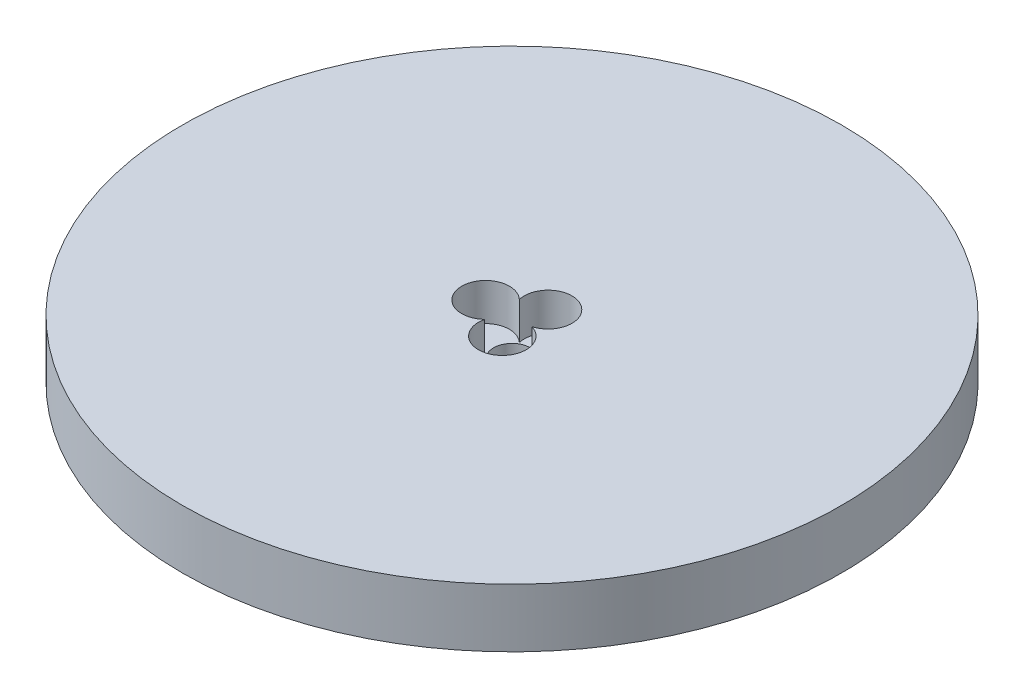
ISO-10303-21;
HEADER;
FILE_DESCRIPTION(('STEP AP214'),'2;1');
FILE_NAME('part.step','',(''),(''),'','','');
FILE_SCHEMA(('AUTOMOTIVE_DESIGN { 1 0 10303 214 1 1 1 1 }'));
ENDSEC;
DATA;
#1=APPLICATION_CONTEXT('core data for automotive mechanical design processes');
#2=APPLICATION_PROTOCOL_DEFINITION('international standard','automotive_design',2000,#1);
#3=PRODUCT_CONTEXT('',#1,'mechanical');
#4=PRODUCT('Part','Part','',(#3));
#5=PRODUCT_RELATED_PRODUCT_CATEGORY('part','',(#4));
#6=PRODUCT_DEFINITION_FORMATION('','',#4);
#7=PRODUCT_DEFINITION_CONTEXT('part definition',#1,'design');
#8=PRODUCT_DEFINITION('design','',#6,#7);
#9=PRODUCT_DEFINITION_SHAPE('','',#8);
#10=(LENGTH_UNIT() NAMED_UNIT(*) SI_UNIT(.MILLI.,.METRE.));
#11=(NAMED_UNIT(*) PLANE_ANGLE_UNIT() SI_UNIT($,.RADIAN.));
#12=(NAMED_UNIT(*) SI_UNIT($,.STERADIAN.) SOLID_ANGLE_UNIT());
#13=UNCERTAINTY_MEASURE_WITH_UNIT(LENGTH_MEASURE(1.E-05),#10,'distance_accuracy_value','');
#14=(GEOMETRIC_REPRESENTATION_CONTEXT(3) GLOBAL_UNCERTAINTY_ASSIGNED_CONTEXT((#13)) GLOBAL_UNIT_ASSIGNED_CONTEXT((#10,
#11,#12)) REPRESENTATION_CONTEXT('',''));
#15=CARTESIAN_POINT('',(0.,0.,0.));
#16=DIRECTION('',(0.,0.,1.));
#17=DIRECTION('',(1.,0.,0.));
#18=AXIS2_PLACEMENT_3D('',#15,#16,#17);
#19=CARTESIAN_POINT('',(0.,16.,0.));
#20=DIRECTION('',(0.,-1.,0.));
#21=DIRECTION('',(0.,0.,-1.));
#22=AXIS2_PLACEMENT_3D('',#19,#20,#21);
#23=CYLINDRICAL_SURFACE('',#22,5.);
#24=CARTESIAN_POINT('',(0.,0.,0.));
#25=DIRECTION('',(0.,1.,0.));
#26=DIRECTION('',(0.,0.,1.));
#27=AXIS2_PLACEMENT_3D('',#24,#25,#26);
#28=CIRCLE('',#27,5.);
#29=CARTESIAN_POINT('',(0.,0.,5.));
#30=VERTEX_POINT('',#29);
#31=EDGE_CURVE('E98',#30,#30,#28,.T.);
#32=ORIENTED_EDGE('',*,*,#31,.F.);
#33=EDGE_LOOP('',(#32));
#34=FACE_BOUND('',#33,.T.);
#35=CARTESIAN_POINT('',(0.,5.79854807496091,0.));
#36=DIRECTION('',(0.,1.,0.));
#37=DIRECTION('',(0.,0.,1.));
#38=AXIS2_PLACEMENT_3D('',#35,#36,#37);
#39=CIRCLE('',#38,5.);
#40=CARTESIAN_POINT('',(0.,5.79854807496091,5.));
#41=VERTEX_POINT('',#40);
#42=EDGE_CURVE('E11',#41,#41,#39,.T.);
#43=ORIENTED_EDGE('',*,*,#42,.T.);
#44=EDGE_LOOP('',(#43));
#45=FACE_BOUND('',#44,.T.);
#46=ADVANCED_FACE('F39',(#34,#45),#23,.F.);
#47=CARTESIAN_POINT('',(0.,16.,0.));
#48=DIRECTION('',(0.,-1.,0.));
#49=DIRECTION('',(0.,0.,-1.));
#50=AXIS2_PLACEMENT_3D('',#47,#48,#49);
#51=CYLINDRICAL_SURFACE('',#50,90.);
#52=CARTESIAN_POINT('',(0.,16.,0.));
#53=DIRECTION('',(0.,1.,0.));
#54=DIRECTION('',(0.,0.,1.));
#55=AXIS2_PLACEMENT_3D('',#52,#53,#54);
#56=CIRCLE('',#55,90.);
#57=CARTESIAN_POINT('',(0.,16.,90.));
#58=VERTEX_POINT('',#57);
#59=EDGE_CURVE('E50',#58,#58,#56,.T.);
#60=ORIENTED_EDGE('',*,*,#59,.F.);
#61=EDGE_LOOP('',(#60));
#62=FACE_BOUND('',#61,.T.);
#63=CARTESIAN_POINT('',(0.,0.,0.));
#64=DIRECTION('',(0.,1.,0.));
#65=DIRECTION('',(0.,0.,1.));
#66=AXIS2_PLACEMENT_3D('',#63,#64,#65);
#67=CIRCLE('',#66,90.);
#68=CARTESIAN_POINT('',(0.,0.,90.));
#69=VERTEX_POINT('',#68);
#70=EDGE_CURVE('E103',#69,#69,#67,.T.);
#71=ORIENTED_EDGE('',*,*,#70,.T.);
#72=EDGE_LOOP('',(#71));
#73=FACE_BOUND('',#72,.T.);
#74=ADVANCED_FACE('F41',(#62,#73),#51,.T.);
#75=CARTESIAN_POINT('',(0.,16.,0.));
#76=DIRECTION('',(0.,1.,0.));
#77=DIRECTION('',(0.,0.,1.));
#78=AXIS2_PLACEMENT_3D('',#75,#76,#77);
#79=PLANE('',#78);
#80=CARTESIAN_POINT('',(3.60726284057422,16.,6.24796251612971));
#81=DIRECTION('',(0.,1.,0.));
#82=DIRECTION('',(0.866025403784436,0.,-0.500000000000004));
#83=AXIS2_PLACEMENT_3D('',#80,#81,#82);
#84=CIRCLE('',#83,6.51380838415946);
#85=CARTESIAN_POINT('',(-2.72459071126902,16.,4.71912954174819));
#86=VERTEX_POINT('',#85);
#87=CARTESIAN_POINT('',(5.44918142253806,16.,0.));
#88=VERTEX_POINT('',#87);
#89=EDGE_CURVE('E83',#86,#88,#84,.T.);
#90=ORIENTED_EDGE('',*,*,#89,.F.);
#91=CARTESIAN_POINT('',(-7.21452568114838,16.,0.));
#92=DIRECTION('',(0.,1.,0.));
#93=DIRECTION('',(0.,0.,1.));
#94=AXIS2_PLACEMENT_3D('',#91,#92,#93);
#95=CIRCLE('',#94,6.51380838415946);
#96=CARTESIAN_POINT('',(-2.72459071126912,16.,-4.71912954174829));
#97=VERTEX_POINT('',#96);
#98=EDGE_CURVE('E96',#97,#86,#95,.T.);
#99=ORIENTED_EDGE('',*,*,#98,.F.);
#100=CARTESIAN_POINT('',(3.60726284057413,16.,-6.24796251612976));
#101=DIRECTION('',(0.,1.,0.));
#102=DIRECTION('',(-0.866025403784443,0.,-0.499999999999992));
#103=AXIS2_PLACEMENT_3D('',#100,#101,#102);
#104=CIRCLE('',#103,6.51380838415946);
#105=EDGE_CURVE('E53',#88,#97,#104,.T.);
#106=ORIENTED_EDGE('',*,*,#105,.F.);
#107=EDGE_LOOP('',(#90,#99,#106));
#108=FACE_BOUND('',#107,.T.);
#109=ORIENTED_EDGE('',*,*,#59,.T.);
#110=EDGE_LOOP('',(#109));
#111=FACE_BOUND('',#110,.T.);
#112=ADVANCED_FACE('F115',(#108,#111),#79,.T.);
#113=CARTESIAN_POINT('',(0.,0.,0.));
#114=DIRECTION('',(0.,1.,0.));
#115=DIRECTION('',(0.,0.,1.));
#116=AXIS2_PLACEMENT_3D('',#113,#114,#115);
#117=PLANE('',#116);
#118=ORIENTED_EDGE('',*,*,#31,.T.);
#119=EDGE_LOOP('',(#118));
#120=FACE_BOUND('',#119,.T.);
#121=ORIENTED_EDGE('',*,*,#70,.F.);
#122=EDGE_LOOP('',(#121));
#123=FACE_BOUND('',#122,.T.);
#124=ADVANCED_FACE('F108',(#120,#123),#117,.F.);
#125=CARTESIAN_POINT('',(-7.21452568114838,5.79854807496091,0.));
#126=DIRECTION('',(0.,1.,0.));
#127=DIRECTION('',(0.,0.,1.));
#128=AXIS2_PLACEMENT_3D('',#125,#126,#127);
#129=CYLINDRICAL_SURFACE('',#128,6.51380838415946);
#130=ORIENTED_EDGE('',*,*,#98,.T.);
#131=DIRECTION('',(0.,1.,0.));
#132=VECTOR('',#131,1.);
#133=CARTESIAN_POINT('',(-2.72459071126902,10.8992740374805,4.71912954174819));
#134=LINE('',#133,#132);
#135=CARTESIAN_POINT('',(-2.72459071126902,5.79854807496091,4.71912954174819));
#136=VERTEX_POINT('',#135);
#137=EDGE_CURVE('E65',#86,#136,#134,.F.);
#138=ORIENTED_EDGE('',*,*,#137,.T.);
#139=CARTESIAN_POINT('',(-7.21452568114838,5.79854807496091,0.));
#140=DIRECTION('',(0.,1.,0.));
#141=DIRECTION('',(0.,0.,1.));
#142=AXIS2_PLACEMENT_3D('',#139,#140,#141);
#143=CIRCLE('',#142,6.51380838415946);
#144=CARTESIAN_POINT('',(-2.72459071126912,5.79854807496091,-4.71912954174828));
#145=VERTEX_POINT('',#144);
#146=EDGE_CURVE('E85',#145,#136,#143,.T.);
#147=ORIENTED_EDGE('',*,*,#146,.F.);
#148=DIRECTION('',(0.,1.,0.));
#149=VECTOR('',#148,1.);
#150=CARTESIAN_POINT('',(-2.72459071126912,10.8992740374805,-4.71912954174828));
#151=LINE('',#150,#149);
#152=EDGE_CURVE('E82',#145,#97,#151,.T.);
#153=ORIENTED_EDGE('',*,*,#152,.T.);
#154=EDGE_LOOP('',(#130,#138,#147,#153));
#155=FACE_BOUND('',#154,.T.);
#156=ADVANCED_FACE('F112',(#155),#129,.F.);
#157=CARTESIAN_POINT('',(-7.21452568114838,5.79854807496091,0.));
#158=DIRECTION('',(0.,1.,0.));
#159=DIRECTION('',(0.,0.,1.));
#160=AXIS2_PLACEMENT_3D('',#157,#158,#159);
#161=PLANE('',#160);
#162=ORIENTED_EDGE('',*,*,#146,.T.);
#163=CARTESIAN_POINT('',(3.60726284057422,5.79854807496091,6.24796251612971));
#164=DIRECTION('',(0.,1.,0.));
#165=DIRECTION('',(0.866025403784436,0.,-0.500000000000004));
#166=AXIS2_PLACEMENT_3D('',#163,#164,#165);
#167=CIRCLE('',#166,6.51380838415946);
#168=CARTESIAN_POINT('',(5.44918142253806,5.79854807496091,0.));
#169=VERTEX_POINT('',#168);
#170=EDGE_CURVE('E73',#136,#169,#167,.T.);
#171=ORIENTED_EDGE('',*,*,#170,.T.);
#172=CARTESIAN_POINT('',(3.60726284057413,5.79854807496091,-6.24796251612976));
#173=DIRECTION('',(0.,1.,0.));
#174=DIRECTION('',(-0.866025403784443,0.,-0.499999999999992));
#175=AXIS2_PLACEMENT_3D('',#172,#173,#174);
#176=CIRCLE('',#175,6.51380838415946);
#177=EDGE_CURVE('E79',#169,#145,#176,.T.);
#178=ORIENTED_EDGE('',*,*,#177,.T.);
#179=EDGE_LOOP('',(#162,#171,#178));
#180=FACE_BOUND('',#179,.T.);
#181=ORIENTED_EDGE('',*,*,#42,.F.);
#182=EDGE_LOOP('',(#181));
#183=FACE_BOUND('',#182,.T.);
#184=ADVANCED_FACE('F80',(#180,#183),#161,.T.);
#185=CARTESIAN_POINT('',(3.60726284057422,5.79854807496091,6.24796251612971));
#186=DIRECTION('',(0.,1.,0.));
#187=DIRECTION('',(0.,0.,1.));
#188=AXIS2_PLACEMENT_3D('',#185,#186,#187);
#189=CYLINDRICAL_SURFACE('',#188,6.51380838415946);
#190=ORIENTED_EDGE('',*,*,#89,.T.);
#191=DIRECTION('',(0.,1.,0.));
#192=VECTOR('',#191,1.);
#193=CARTESIAN_POINT('',(5.44918142253806,10.8992740374805,0.));
#194=LINE('',#193,#192);
#195=EDGE_CURVE('E88',#88,#169,#194,.F.);
#196=ORIENTED_EDGE('',*,*,#195,.T.);
#197=ORIENTED_EDGE('',*,*,#170,.F.);
#198=ORIENTED_EDGE('',*,*,#137,.F.);
#199=EDGE_LOOP('',(#190,#196,#197,#198));
#200=FACE_BOUND('',#199,.T.);
#201=ADVANCED_FACE('F87',(#200),#189,.F.);
#202=CARTESIAN_POINT('',(3.60726284057413,5.79854807496091,-6.24796251612976));
#203=DIRECTION('',(0.,1.,0.));
#204=DIRECTION('',(0.,0.,1.));
#205=AXIS2_PLACEMENT_3D('',#202,#203,#204);
#206=CYLINDRICAL_SURFACE('',#205,6.51380838415946);
#207=ORIENTED_EDGE('',*,*,#177,.F.);
#208=ORIENTED_EDGE('',*,*,#195,.F.);
#209=ORIENTED_EDGE('',*,*,#105,.T.);
#210=ORIENTED_EDGE('',*,*,#152,.F.);
#211=EDGE_LOOP('',(#207,#208,#209,#210));
#212=FACE_BOUND('',#211,.T.);
#213=ADVANCED_FACE('F90',(#212),#206,.F.);
#214=CLOSED_SHELL('',(#46,#74,#112,#124,#156,#184,#201,#213));
#215=MANIFOLD_SOLID_BREP('B2',#214);
#216=ADVANCED_BREP_SHAPE_REPRESENTATION('',(#18,#215),#14);
#217=SHAPE_DEFINITION_REPRESENTATION(#9,#216);
ENDSEC;
END-ISO-10303-21;
